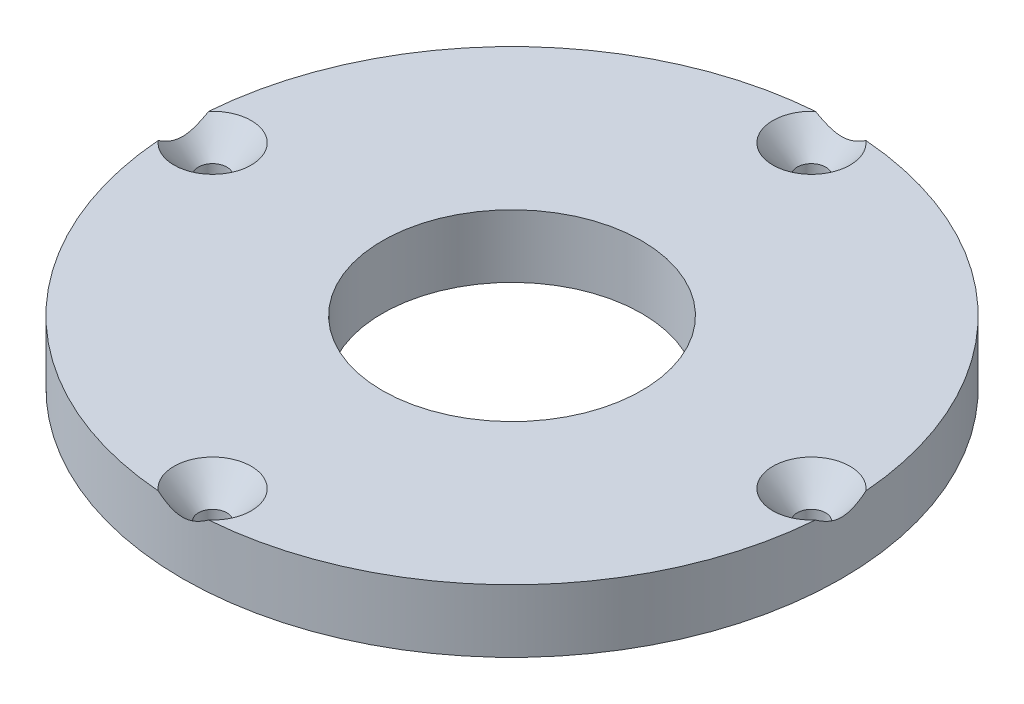
ISO-10303-21;
HEADER;
FILE_DESCRIPTION(('STEP AP214'),'2;1');
FILE_NAME('part.step','',(''),(''),'','','');
FILE_SCHEMA(('AUTOMOTIVE_DESIGN { 1 0 10303 214 1 1 1 1 }'));
ENDSEC;
DATA;
#1=APPLICATION_CONTEXT('core data for automotive mechanical design processes');
#2=APPLICATION_PROTOCOL_DEFINITION('international standard','automotive_design',2000,#1);
#3=PRODUCT_CONTEXT('',#1,'mechanical');
#4=PRODUCT('Part','Part','',(#3));
#5=PRODUCT_RELATED_PRODUCT_CATEGORY('part','',(#4));
#6=PRODUCT_DEFINITION_FORMATION('','',#4);
#7=PRODUCT_DEFINITION_CONTEXT('part definition',#1,'design');
#8=PRODUCT_DEFINITION('design','',#6,#7);
#9=PRODUCT_DEFINITION_SHAPE('','',#8);
#10=(LENGTH_UNIT() NAMED_UNIT(*) SI_UNIT(.MILLI.,.METRE.));
#11=(NAMED_UNIT(*) PLANE_ANGLE_UNIT() SI_UNIT($,.RADIAN.));
#12=(NAMED_UNIT(*) SI_UNIT($,.STERADIAN.) SOLID_ANGLE_UNIT());
#13=UNCERTAINTY_MEASURE_WITH_UNIT(LENGTH_MEASURE(1.E-05),#10,'distance_accuracy_value','');
#14=(GEOMETRIC_REPRESENTATION_CONTEXT(3) GLOBAL_UNCERTAINTY_ASSIGNED_CONTEXT((#13)) GLOBAL_UNIT_ASSIGNED_CONTEXT((#10,
#11,#12)) REPRESENTATION_CONTEXT('',''));
#15=CARTESIAN_POINT('',(0.,0.,0.));
#16=DIRECTION('',(0.,0.,1.));
#17=DIRECTION('',(1.,0.,0.));
#18=AXIS2_PLACEMENT_3D('',#15,#16,#17);
#19=CARTESIAN_POINT('',(0.,6.35,0.));
#20=DIRECTION('',(0.,-1.,0.));
#21=DIRECTION('',(0.,0.,-1.));
#22=AXIS2_PLACEMENT_3D('',#19,#20,#21);
#23=CYLINDRICAL_SURFACE('',#22,33.274);
#24=CARTESIAN_POINT('',(0.,6.35,0.));
#25=DIRECTION('',(0.,1.,0.));
#26=DIRECTION('',(0.,0.,1.));
#27=AXIS2_PLACEMENT_3D('',#24,#25,#26);
#28=CIRCLE('',#27,33.274);
#29=CARTESIAN_POINT('',(-33.1762180042017,6.35,2.5490458877165));
#30=VERTEX_POINT('',#29);
#31=CARTESIAN_POINT('',(-2.54904588771647,6.35,33.1762180042017));
#32=VERTEX_POINT('',#31);
#33=EDGE_CURVE('E64',#30,#32,#28,.T.);
#34=ORIENTED_EDGE('',*,*,#33,.F.);
#35=CARTESIAN_POINT('',(-33.1761955775648,6.3502,2.54933775698086));
#36=CARTESIAN_POINT('',(-33.1805825798049,6.31107939084975,2.49224353407827));
#37=CARTESIAN_POINT('',(-33.1848510304405,6.27250049597728,2.43476969254307));
#38=CARTESIAN_POINT('',(-33.1931441576657,6.19658644675497,2.31897186656584));
#39=CARTESIAN_POINT('',(-33.1971687808717,6.15925156556883,2.26064769939652));
#40=CARTESIAN_POINT('',(-33.2088943013344,6.04909511512583,2.08384553223999));
#41=CARTESIAN_POINT('',(-33.21621273273,5.97842751075451,1.96397900073564));
#42=CARTESIAN_POINT('',(-33.2299267423548,5.84287264009969,1.71662751721354));
#43=CARTESIAN_POINT('',(-33.2362915352426,5.77819684433707,1.58902380768307));
#44=CARTESIAN_POINT('',(-33.2477056933444,5.65973625813034,1.32892352336059));
#45=CARTESIAN_POINT('',(-33.252757166911,5.60593404296546,1.19643518556831));
#46=CARTESIAN_POINT('',(-33.2597607527403,5.53010959344534,0.97700011371498));
#47=CARTESIAN_POINT('',(-33.2621651774734,5.50373063278104,0.89157391111778));
#48=CARTESIAN_POINT('',(-33.2663443566313,5.45749882873885,0.718930100382252));
#49=CARTESIAN_POINT('',(-33.2681190973177,5.4376461277508,0.631712453202316));
#50=CARTESIAN_POINT('',(-33.2709765493234,5.40551094726472,0.456890129599175));
#51=CARTESIAN_POINT('',(-33.2720668907164,5.39314505771044,0.369301096688978));
#52=CARTESIAN_POINT('',(-33.2735544176201,5.3762413742042,0.193361047117015));
#53=CARTESIAN_POINT('',(-33.2739516632509,5.37170290129143,0.105010097213176));
#54=CARTESIAN_POINT('',(-33.2740401673081,5.37069333829633,-0.0720342768338496));
#55=CARTESIAN_POINT('',(-33.2737290643389,5.37424923209352,-0.160727859594178));
#56=CARTESIAN_POINT('',(-33.2724063706862,5.38929227282091,-0.337431416023773));
#57=CARTESIAN_POINT('',(-33.2713947189189,5.40078011136885,-0.425441329404433));
#58=CARTESIAN_POINT('',(-33.2686862677066,5.43128710485559,-0.601168319089554));
#59=CARTESIAN_POINT('',(-33.2669816807199,5.45039181327727,-0.688870240584589));
#60=CARTESIAN_POINT('',(-33.2629329615701,5.49527694915702,-0.862503889061059));
#61=CARTESIAN_POINT('',(-33.2605888461569,5.52105720177418,-0.94843566234128));
#62=CARTESIAN_POINT('',(-33.2536703765143,5.59615482408612,-1.17109467674494));
#63=CARTESIAN_POINT('',(-33.2486149947613,5.65014727225309,-1.30623006374369));
#64=CARTESIAN_POINT('',(-33.2371376661082,5.76954580051192,-1.5714421316998));
#65=CARTESIAN_POINT('',(-33.2307133355823,5.83497175250638,-1.70150951482053));
#66=CARTESIAN_POINT('',(-33.2168373397957,5.97236435376283,-1.9535315600519));
#67=CARTESIAN_POINT('',(-33.2094177537716,6.04410921552668,-2.07561016696838));
#68=CARTESIAN_POINT('',(-33.1975139212334,6.15604068896211,-2.25560127653234));
#69=CARTESIAN_POINT('',(-33.1934262548253,6.19398636529059,-2.3149562707655));
#70=CARTESIAN_POINT('',(-33.1849984365551,6.27116810514676,-2.43278419120686));
#71=CARTESIAN_POINT('',(-33.1806583435334,6.31040386703801,-2.49125731900659));
#72=CARTESIAN_POINT('',(-33.1761955775648,6.3502,-2.54933775698086));
#73=B_SPLINE_CURVE_WITH_KNOTS('',3,(#35,#36,#37,#38,#39,#40,#41,#42,#43,#44,#45,#46,#47,#48,#49,
#50,#51,#52,#53,#54,#55,#56,#57,#58,#59,#60,#61,#62,#63,#64,#65,#66,#67,#68,#69,#70,#71,#72),
.UNSPECIFIED.,.F.,.F.,(4,2,2,2,2,2,2,2,2,2,2,2,2,2,2,2,2,2,4),(0.,0.208043349461832,
0.416132084531599,0.833921512402195,1.26315987875748,1.69170484689115,1.95980491509329,
2.22791083231083,2.49297203327847,2.75801024131868,3.02393329047978,3.28987952945598,
3.55890108157153,3.82791558838638,4.26397379238092,4.70079756122368,5.12593596847389,
5.33762144708327,5.54925777837407),.UNSPECIFIED.);
#74=CARTESIAN_POINT('',(-33.1762180042017,6.35,-2.54904588771648));
#75=VERTEX_POINT('',#74);
#76=EDGE_CURVE('E11',#30,#75,#73,.T.);
#77=ORIENTED_EDGE('',*,*,#76,.T.);
#78=CARTESIAN_POINT('',(-2.5490458877165,6.35,-33.1762180042017));
#79=VERTEX_POINT('',#78);
#80=EDGE_CURVE('E88',#79,#75,#28,.T.);
#81=ORIENTED_EDGE('',*,*,#80,.F.);
#82=CARTESIAN_POINT('',(-2.54933775698085,6.3502,-33.1761955775648));
#83=CARTESIAN_POINT('',(-2.49224353407827,6.31107939084975,-33.1805825798049));
#84=CARTESIAN_POINT('',(-2.43476969254307,6.27250049597728,-33.1848510304405));
#85=CARTESIAN_POINT('',(-2.31897186656584,6.19658644675497,-33.1931441576657));
#86=CARTESIAN_POINT('',(-2.26064769939652,6.15925156556883,-33.1971687808717));
#87=CARTESIAN_POINT('',(-2.08384553223999,6.04909511512584,-33.2088943013344));
#88=CARTESIAN_POINT('',(-1.96397900073564,5.97842751075451,-33.21621273273));
#89=CARTESIAN_POINT('',(-1.71662751721354,5.84287264009969,-33.2299267423548));
#90=CARTESIAN_POINT('',(-1.58902380768307,5.77819684433707,-33.2362915352426));
#91=CARTESIAN_POINT('',(-1.32892352336059,5.65973625813034,-33.2477056933444));
#92=CARTESIAN_POINT('',(-1.19643518556831,5.60593404296546,-33.252757166911));
#93=CARTESIAN_POINT('',(-0.977000113714979,5.53010959344534,-33.2597607527403));
#94=CARTESIAN_POINT('',(-0.891573911117779,5.50373063278104,-33.2621651774734));
#95=CARTESIAN_POINT('',(-0.718930100382251,5.45749882873885,-33.2663443566313));
#96=CARTESIAN_POINT('',(-0.631712453202315,5.4376461277508,-33.2681190973177));
#97=CARTESIAN_POINT('',(-0.456890129599174,5.40551094726472,-33.2709765493234));
#98=CARTESIAN_POINT('',(-0.369301096688977,5.39314505771044,-33.2720668907164));
#99=CARTESIAN_POINT('',(-0.193361047117014,5.3762413742042,-33.2735544176201));
#100=CARTESIAN_POINT('',(-0.105010097213176,5.37170290129142,-33.2739516632509));
#101=CARTESIAN_POINT('',(0.0720342768338502,5.37069333829633,-33.2740401673081));
#102=CARTESIAN_POINT('',(0.160727859594178,5.37424923209353,-33.2737290643389));
#103=CARTESIAN_POINT('',(0.337431416023774,5.38929227282091,-33.2724063706862));
#104=CARTESIAN_POINT('',(0.425441329404434,5.40078011136885,-33.2713947189189));
#105=CARTESIAN_POINT('',(0.601168319089555,5.43128710485559,-33.2686862677066));
#106=CARTESIAN_POINT('',(0.68887024058459,5.45039181327727,-33.2669816807199));
#107=CARTESIAN_POINT('',(0.86250388906106,5.49527694915702,-33.2629329615701));
#108=CARTESIAN_POINT('',(0.948435662341281,5.52105720177418,-33.2605888461569));
#109=CARTESIAN_POINT('',(1.17109467674494,5.59615482408612,-33.2536703765143));
#110=CARTESIAN_POINT('',(1.30623006374369,5.65014727225309,-33.2486149947613));
#111=CARTESIAN_POINT('',(1.5714421316998,5.76954580051192,-33.2371376661082));
#112=CARTESIAN_POINT('',(1.70150951482053,5.83497175250639,-33.2307133355823));
#113=CARTESIAN_POINT('',(1.9535315600519,5.97236435376283,-33.2168373397957));
#114=CARTESIAN_POINT('',(2.07561016696838,6.04410921552668,-33.2094177537716));
#115=CARTESIAN_POINT('',(2.25560127653234,6.15604068896211,-33.1975139212334));
#116=CARTESIAN_POINT('',(2.3149562707655,6.19398636529059,-33.1934262548253));
#117=CARTESIAN_POINT('',(2.43278419120686,6.27116810514676,-33.1849984365551));
#118=CARTESIAN_POINT('',(2.49125731900659,6.31040386703801,-33.1806583435334));
#119=CARTESIAN_POINT('',(2.54933775698085,6.3502,-33.1761955775648));
#120=B_SPLINE_CURVE_WITH_KNOTS('',3,(#82,#83,#84,#85,#86,#87,#88,#89,#90,#91,#92,#93,#94,#95,
#96,#97,#98,#99,#100,#101,#102,#103,#104,#105,#106,#107,#108,#109,#110,#111,#112,#113,#114,#115,
#116,#117,#118,#119),.UNSPECIFIED.,.F.,.F.,(4,2,2,2,2,2,2,2,2,2,2,2,2,2,2,2,2,2,4),(0.,
0.208043349461831,0.416132084531599,0.833921512402194,1.26315987875747,1.69170484689115,
1.95980491509329,2.22791083231083,2.49297203327847,2.75801024131868,3.02393329047978,
3.28987952945598,3.55890108157154,3.82791558838638,4.26397379238092,4.70079756122368,
5.12593596847389,5.33762144708327,5.54925777837407),.UNSPECIFIED.);
#121=CARTESIAN_POINT('',(2.54904588771647,6.35,-33.1762180042017));
#122=VERTEX_POINT('',#121);
#123=EDGE_CURVE('E102',#79,#122,#120,.T.);
#124=ORIENTED_EDGE('',*,*,#123,.T.);
#125=CARTESIAN_POINT('',(33.1762180042017,6.35,-2.5490458877165));
#126=VERTEX_POINT('',#125);
#127=EDGE_CURVE('E103',#126,#122,#28,.T.);
#128=ORIENTED_EDGE('',*,*,#127,.F.);
#129=CARTESIAN_POINT('',(33.1761955775648,6.3502,-2.54933775698086));
#130=CARTESIAN_POINT('',(33.1805825798049,6.31107939084975,-2.49224353407827));
#131=CARTESIAN_POINT('',(33.1848510304405,6.27250049597728,-2.43476969254307));
#132=CARTESIAN_POINT('',(33.1931441576657,6.19658644675497,-2.31897186656584));
#133=CARTESIAN_POINT('',(33.1971687808717,6.15925156556883,-2.26064769939652));
#134=CARTESIAN_POINT('',(33.2088943013344,6.04909511512583,-2.08384553223999));
#135=CARTESIAN_POINT('',(33.21621273273,5.97842751075451,-1.96397900073564));
#136=CARTESIAN_POINT('',(33.2299267423548,5.84287264009969,-1.71662751721354));
#137=CARTESIAN_POINT('',(33.2362915352426,5.77819684433707,-1.58902380768307));
#138=CARTESIAN_POINT('',(33.2477056933444,5.65973625813034,-1.32892352336059));
#139=CARTESIAN_POINT('',(33.252757166911,5.60593404296546,-1.19643518556831));
#140=CARTESIAN_POINT('',(33.2597607527403,5.53010959344534,-0.97700011371498));
#141=CARTESIAN_POINT('',(33.2621651774734,5.50373063278104,-0.89157391111778));
#142=CARTESIAN_POINT('',(33.2663443566313,5.45749882873885,-0.718930100382252));
#143=CARTESIAN_POINT('',(33.2681190973177,5.4376461277508,-0.631712453202316));
#144=CARTESIAN_POINT('',(33.2709765493234,5.40551094726472,-0.456890129599175));
#145=CARTESIAN_POINT('',(33.2720668907164,5.39314505771044,-0.369301096688978));
#146=CARTESIAN_POINT('',(33.2735544176201,5.3762413742042,-0.193361047117015));
#147=CARTESIAN_POINT('',(33.2739516632509,5.37170290129143,-0.105010097213176));
#148=CARTESIAN_POINT('',(33.2740401673081,5.37069333829633,0.0720342768338496));
#149=CARTESIAN_POINT('',(33.2737290643389,5.37424923209352,0.160727859594178));
#150=CARTESIAN_POINT('',(33.2724063706862,5.38929227282091,0.337431416023773));
#151=CARTESIAN_POINT('',(33.2713947189189,5.40078011136885,0.425441329404433));
#152=CARTESIAN_POINT('',(33.2686862677066,5.43128710485559,0.601168319089554));
#153=CARTESIAN_POINT('',(33.2669816807199,5.45039181327727,0.688870240584589));
#154=CARTESIAN_POINT('',(33.2629329615701,5.49527694915702,0.862503889061059));
#155=CARTESIAN_POINT('',(33.2605888461569,5.52105720177418,0.94843566234128));
#156=CARTESIAN_POINT('',(33.2536703765143,5.59615482408612,1.17109467674494));
#157=CARTESIAN_POINT('',(33.2486149947613,5.65014727225309,1.30623006374369));
#158=CARTESIAN_POINT('',(33.2371376661082,5.76954580051192,1.5714421316998));
#159=CARTESIAN_POINT('',(33.2307133355823,5.83497175250638,1.70150951482053));
#160=CARTESIAN_POINT('',(33.2168373397957,5.97236435376283,1.9535315600519));
#161=CARTESIAN_POINT('',(33.2094177537716,6.04410921552668,2.07561016696838));
#162=CARTESIAN_POINT('',(33.1975139212334,6.15604068896211,2.25560127653234));
#163=CARTESIAN_POINT('',(33.1934262548253,6.19398636529059,2.3149562707655));
#164=CARTESIAN_POINT('',(33.1849984365551,6.27116810514676,2.43278419120686));
#165=CARTESIAN_POINT('',(33.1806583435334,6.31040386703801,2.49125731900659));
#166=CARTESIAN_POINT('',(33.1761955775648,6.3502,2.54933775698086));
#167=B_SPLINE_CURVE_WITH_KNOTS('',3,(#129,#130,#131,#132,#133,#134,#135,#136,#137,#138,#139,
#140,#141,#142,#143,#144,#145,#146,#147,#148,#149,#150,#151,#152,#153,#154,#155,#156,#157,#158,
#159,#160,#161,#162,#163,#164,#165,#166),.UNSPECIFIED.,.F.,.F.,(4,2,2,2,2,2,2,2,2,2,2,2,2,2,2,2,
2,2,4),(0.,0.208043349461832,0.416132084531599,0.833921512402195,1.26315987875748,
1.69170484689115,1.95980491509329,2.22791083231083,2.49297203327847,2.75801024131868,
3.02393329047978,3.28987952945598,3.55890108157153,3.82791558838638,4.26397379238092,
4.70079756122368,5.12593596847389,5.33762144708327,5.54925777837407),.UNSPECIFIED.);
#168=CARTESIAN_POINT('',(33.1762180042017,6.35,2.54904588771648));
#169=VERTEX_POINT('',#168);
#170=EDGE_CURVE('E121',#126,#169,#167,.T.);
#171=ORIENTED_EDGE('',*,*,#170,.T.);
#172=CARTESIAN_POINT('',(2.5490458877165,6.35,33.1762180042017));
#173=VERTEX_POINT('',#172);
#174=EDGE_CURVE('E97',#173,#169,#28,.T.);
#175=ORIENTED_EDGE('',*,*,#174,.F.);
#176=CARTESIAN_POINT('',(2.54933775698085,6.3502,33.1761955775648));
#177=CARTESIAN_POINT('',(2.49224353407827,6.31107939084975,33.1805825798049));
#178=CARTESIAN_POINT('',(2.43476969254307,6.27250049597728,33.1848510304405));
#179=CARTESIAN_POINT('',(2.31897186656584,6.19658644675497,33.1931441576657));
#180=CARTESIAN_POINT('',(2.26064769939652,6.15925156556883,33.1971687808717));
#181=CARTESIAN_POINT('',(2.08384553223999,6.04909511512584,33.2088943013344));
#182=CARTESIAN_POINT('',(1.96397900073564,5.97842751075451,33.21621273273));
#183=CARTESIAN_POINT('',(1.71662751721354,5.84287264009969,33.2299267423548));
#184=CARTESIAN_POINT('',(1.58902380768307,5.77819684433707,33.2362915352426));
#185=CARTESIAN_POINT('',(1.32892352336059,5.65973625813034,33.2477056933444));
#186=CARTESIAN_POINT('',(1.19643518556831,5.60593404296546,33.252757166911));
#187=CARTESIAN_POINT('',(0.977000113714979,5.53010959344534,33.2597607527403));
#188=CARTESIAN_POINT('',(0.891573911117779,5.50373063278104,33.2621651774734));
#189=CARTESIAN_POINT('',(0.718930100382251,5.45749882873885,33.2663443566313));
#190=CARTESIAN_POINT('',(0.631712453202315,5.4376461277508,33.2681190973177));
#191=CARTESIAN_POINT('',(0.456890129599174,5.40551094726472,33.2709765493234));
#192=CARTESIAN_POINT('',(0.369301096688977,5.39314505771044,33.2720668907164));
#193=CARTESIAN_POINT('',(0.193361047117014,5.3762413742042,33.2735544176201));
#194=CARTESIAN_POINT('',(0.105010097213176,5.37170290129142,33.2739516632509));
#195=CARTESIAN_POINT('',(-0.0720342768338502,5.37069333829633,33.2740401673081));
#196=CARTESIAN_POINT('',(-0.160727859594178,5.37424923209353,33.2737290643389));
#197=CARTESIAN_POINT('',(-0.337431416023774,5.38929227282091,33.2724063706862));
#198=CARTESIAN_POINT('',(-0.425441329404434,5.40078011136885,33.2713947189189));
#199=CARTESIAN_POINT('',(-0.601168319089555,5.43128710485559,33.2686862677066));
#200=CARTESIAN_POINT('',(-0.68887024058459,5.45039181327727,33.2669816807199));
#201=CARTESIAN_POINT('',(-0.86250388906106,5.49527694915702,33.2629329615701));
#202=CARTESIAN_POINT('',(-0.948435662341281,5.52105720177418,33.2605888461569));
#203=CARTESIAN_POINT('',(-1.17109467674494,5.59615482408612,33.2536703765143));
#204=CARTESIAN_POINT('',(-1.30623006374369,5.65014727225309,33.2486149947613));
#205=CARTESIAN_POINT('',(-1.5714421316998,5.76954580051192,33.2371376661082));
#206=CARTESIAN_POINT('',(-1.70150951482053,5.83497175250639,33.2307133355823));
#207=CARTESIAN_POINT('',(-1.9535315600519,5.97236435376283,33.2168373397957));
#208=CARTESIAN_POINT('',(-2.07561016696838,6.04410921552668,33.2094177537716));
#209=CARTESIAN_POINT('',(-2.25560127653234,6.15604068896211,33.1975139212334));
#210=CARTESIAN_POINT('',(-2.3149562707655,6.19398636529059,33.1934262548253));
#211=CARTESIAN_POINT('',(-2.43278419120686,6.27116810514676,33.1849984365551));
#212=CARTESIAN_POINT('',(-2.49125731900659,6.31040386703801,33.1806583435334));
#213=CARTESIAN_POINT('',(-2.54933775698085,6.3502,33.1761955775648));
#214=B_SPLINE_CURVE_WITH_KNOTS('',3,(#176,#177,#178,#179,#180,#181,#182,#183,#184,#185,#186,
#187,#188,#189,#190,#191,#192,#193,#194,#195,#196,#197,#198,#199,#200,#201,#202,#203,#204,#205,
#206,#207,#208,#209,#210,#211,#212,#213),.UNSPECIFIED.,.F.,.F.,(4,2,2,2,2,2,2,2,2,2,2,2,2,2,2,2,
2,2,4),(0.,0.208043349461831,0.416132084531599,0.833921512402194,1.26315987875747,
1.69170484689115,1.95980491509329,2.22791083231083,2.49297203327847,2.75801024131868,
3.02393329047978,3.28987952945598,3.55890108157154,3.82791558838638,4.26397379238092,
4.70079756122368,5.12593596847389,5.33762144708327,5.54925777837407),.UNSPECIFIED.);
#215=EDGE_CURVE('E52',#173,#32,#214,.T.);
#216=ORIENTED_EDGE('',*,*,#215,.T.);
#217=EDGE_LOOP('',(#34,#77,#81,#124,#128,#171,#175,#216));
#218=FACE_BOUND('',#217,.T.);
#219=CARTESIAN_POINT('',(0.,0.,0.));
#220=DIRECTION('',(0.,1.,0.));
#221=DIRECTION('',(0.,0.,1.));
#222=AXIS2_PLACEMENT_3D('',#219,#220,#221);
#223=CIRCLE('',#222,33.274);
#224=CARTESIAN_POINT('',(0.,0.,33.274));
#225=VERTEX_POINT('',#224);
#226=EDGE_CURVE('E108',#225,#225,#223,.T.);
#227=ORIENTED_EDGE('',*,*,#226,.T.);
#228=EDGE_LOOP('',(#227));
#229=FACE_BOUND('',#228,.T.);
#230=ADVANCED_FACE('F42',(#218,#229),#23,.T.);
#231=CARTESIAN_POINT('',(0.,6.35,0.));
#232=DIRECTION('',(0.,1.,0.));
#233=DIRECTION('',(0.,0.,1.));
#234=AXIS2_PLACEMENT_3D('',#231,#232,#233);
#235=PLANE('',#234);
#236=CARTESIAN_POINT('',(0.,6.35,0.));
#237=DIRECTION('',(0.,1.,0.));
#238=DIRECTION('',(0.,0.,1.));
#239=AXIS2_PLACEMENT_3D('',#236,#237,#238);
#240=CIRCLE('',#239,13.096875);
#241=CARTESIAN_POINT('',(0.,6.35,13.096875));
#242=VERTEX_POINT('',#241);
#243=EDGE_CURVE('E372',#242,#242,#240,.T.);
#244=ORIENTED_EDGE('',*,*,#243,.F.);
#245=EDGE_LOOP('',(#244));
#246=FACE_BOUND('',#245,.T.);
#247=CARTESIAN_POINT('',(-30.226,6.35,0.));
#248=DIRECTION('',(0.,1.,0.));
#249=DIRECTION('',(0.,0.,1.));
#250=AXIS2_PLACEMENT_3D('',#247,#248,#249);
#251=CIRCLE('',#250,3.8989);
#252=EDGE_CURVE('E58',#30,#75,#251,.T.);
#253=ORIENTED_EDGE('',*,*,#252,.F.);
#254=ORIENTED_EDGE('',*,*,#33,.T.);
#255=CARTESIAN_POINT('',(0.,6.35,30.226));
#256=DIRECTION('',(0.,1.,0.));
#257=DIRECTION('',(0.,0.,1.));
#258=AXIS2_PLACEMENT_3D('',#255,#256,#257);
#259=CIRCLE('',#258,3.8989);
#260=EDGE_CURVE('E359',#173,#32,#259,.T.);
#261=ORIENTED_EDGE('',*,*,#260,.F.);
#262=ORIENTED_EDGE('',*,*,#174,.T.);
#263=CARTESIAN_POINT('',(30.226,6.35,0.));
#264=DIRECTION('',(0.,1.,0.));
#265=DIRECTION('',(0.,0.,1.));
#266=AXIS2_PLACEMENT_3D('',#263,#264,#265);
#267=CIRCLE('',#266,3.8989);
#268=EDGE_CURVE('E327',#126,#169,#267,.T.);
#269=ORIENTED_EDGE('',*,*,#268,.F.);
#270=ORIENTED_EDGE('',*,*,#127,.T.);
#271=CARTESIAN_POINT('',(0.,6.35,-30.226));
#272=DIRECTION('',(0.,1.,0.));
#273=DIRECTION('',(0.,0.,1.));
#274=AXIS2_PLACEMENT_3D('',#271,#272,#273);
#275=CIRCLE('',#274,3.8989);
#276=EDGE_CURVE('E320',#79,#122,#275,.T.);
#277=ORIENTED_EDGE('',*,*,#276,.F.);
#278=ORIENTED_EDGE('',*,*,#80,.T.);
#279=EDGE_LOOP('',(#253,#254,#261,#262,#269,#270,#277,#278));
#280=FACE_BOUND('',#279,.T.);
#281=ADVANCED_FACE('F86',(#246,#280),#235,.T.);
#282=CARTESIAN_POINT('',(0.,0.,0.));
#283=DIRECTION('',(0.,1.,0.));
#284=DIRECTION('',(0.,0.,1.));
#285=AXIS2_PLACEMENT_3D('',#282,#283,#284);
#286=PLANE('',#285);
#287=CARTESIAN_POINT('',(0.,0.,0.));
#288=DIRECTION('',(0.,1.,0.));
#289=DIRECTION('',(0.,0.,1.));
#290=AXIS2_PLACEMENT_3D('',#287,#288,#289);
#291=CIRCLE('',#290,13.096875);
#292=CARTESIAN_POINT('',(0.,0.,13.096875));
#293=VERTEX_POINT('',#292);
#294=EDGE_CURVE('E91',#293,#293,#291,.T.);
#295=ORIENTED_EDGE('',*,*,#294,.T.);
#296=EDGE_LOOP('',(#295));
#297=FACE_BOUND('',#296,.T.);
#298=CARTESIAN_POINT('',(-30.226,0.,0.));
#299=DIRECTION('',(0.,1.,0.));
#300=DIRECTION('',(0.,0.,1.));
#301=AXIS2_PLACEMENT_3D('',#298,#299,#300);
#302=CIRCLE('',#301,1.43509999999999);
#303=CARTESIAN_POINT('',(-30.226,0.,1.43509999999999));
#304=VERTEX_POINT('',#303);
#305=EDGE_CURVE('E46',#304,#304,#302,.T.);
#306=ORIENTED_EDGE('',*,*,#305,.T.);
#307=EDGE_LOOP('',(#306));
#308=FACE_BOUND('',#307,.T.);
#309=CARTESIAN_POINT('',(0.,0.,30.226));
#310=DIRECTION('',(0.,1.,0.));
#311=DIRECTION('',(0.,0.,1.));
#312=AXIS2_PLACEMENT_3D('',#309,#310,#311);
#313=CIRCLE('',#312,1.43509999999999);
#314=CARTESIAN_POINT('',(0.,0.,31.6611));
#315=VERTEX_POINT('',#314);
#316=EDGE_CURVE('E340',#315,#315,#313,.T.);
#317=ORIENTED_EDGE('',*,*,#316,.T.);
#318=EDGE_LOOP('',(#317));
#319=FACE_BOUND('',#318,.T.);
#320=CARTESIAN_POINT('',(30.226,0.,0.));
#321=DIRECTION('',(0.,1.,0.));
#322=DIRECTION('',(0.,0.,1.));
#323=AXIS2_PLACEMENT_3D('',#320,#321,#322);
#324=CIRCLE('',#323,1.43509999999999);
#325=CARTESIAN_POINT('',(30.226,0.,1.43509999999999));
#326=VERTEX_POINT('',#325);
#327=EDGE_CURVE('E317',#326,#326,#324,.T.);
#328=ORIENTED_EDGE('',*,*,#327,.T.);
#329=EDGE_LOOP('',(#328));
#330=FACE_BOUND('',#329,.T.);
#331=CARTESIAN_POINT('',(0.,0.,-30.226));
#332=DIRECTION('',(0.,1.,0.));
#333=DIRECTION('',(0.,0.,1.));
#334=AXIS2_PLACEMENT_3D('',#331,#332,#333);
#335=CIRCLE('',#334,1.43509999999999);
#336=CARTESIAN_POINT('',(0.,0.,-28.7909));
#337=VERTEX_POINT('',#336);
#338=EDGE_CURVE('E112',#337,#337,#335,.T.);
#339=ORIENTED_EDGE('',*,*,#338,.T.);
#340=EDGE_LOOP('',(#339));
#341=FACE_BOUND('',#340,.T.);
#342=ORIENTED_EDGE('',*,*,#226,.F.);
#343=EDGE_LOOP('',(#342));
#344=FACE_BOUND('',#343,.T.);
#345=ADVANCED_FACE('F134',(#297,#308,#319,#330,#341,#344),#286,.F.);
#346=CARTESIAN_POINT('',(0.,6.35,-30.226));
#347=DIRECTION('',(0.,1.,0.));
#348=DIRECTION('',(0.,0.,1.));
#349=AXIS2_PLACEMENT_3D('',#346,#347,#348);
#350=CYLINDRICAL_SURFACE('',#349,1.43509999999999);
#351=CARTESIAN_POINT('',(0.,3.51572231828888,-30.226));
#352=DIRECTION('',(0.,1.,0.));
#353=DIRECTION('',(0.,0.,1.));
#354=AXIS2_PLACEMENT_3D('',#351,#352,#353);
#355=CIRCLE('',#354,1.4351);
#356=CARTESIAN_POINT('',(0.,3.51572231828888,-28.7909));
#357=VERTEX_POINT('',#356);
#358=EDGE_CURVE('E106',#357,#357,#355,.T.);
#359=ORIENTED_EDGE('',*,*,#358,.T.);
#360=EDGE_LOOP('',(#359));
#361=FACE_BOUND('',#360,.T.);
#362=ORIENTED_EDGE('',*,*,#338,.F.);
#363=EDGE_LOOP('',(#362));
#364=FACE_BOUND('',#363,.T.);
#365=ADVANCED_FACE('F129',(#361,#364),#350,.F.);
#366=CARTESIAN_POINT('',(0.,6.35,-30.226));
#367=DIRECTION('',(0.,1.,0.));
#368=DIRECTION('',(0.,0.,1.));
#369=AXIS2_PLACEMENT_3D('',#366,#367,#368);
#370=CONICAL_SURFACE('',#369,3.8989,0.715584993317676);
#371=ORIENTED_EDGE('',*,*,#358,.F.);
#372=EDGE_LOOP('',(#371));
#373=FACE_BOUND('',#372,.T.);
#374=ORIENTED_EDGE('',*,*,#276,.T.);
#375=ORIENTED_EDGE('',*,*,#123,.F.);
#376=EDGE_LOOP('',(#374,#375));
#377=FACE_BOUND('',#376,.T.);
#378=ADVANCED_FACE('F123',(#373,#377),#370,.F.);
#379=CARTESIAN_POINT('',(30.226,6.35,0.));
#380=DIRECTION('',(0.,1.,0.));
#381=DIRECTION('',(0.,0.,1.));
#382=AXIS2_PLACEMENT_3D('',#379,#380,#381);
#383=CYLINDRICAL_SURFACE('',#382,1.43509999999999);
#384=CARTESIAN_POINT('',(30.226,3.51572231828888,0.));
#385=DIRECTION('',(0.,1.,0.));
#386=DIRECTION('',(0.,0.,1.));
#387=AXIS2_PLACEMENT_3D('',#384,#385,#386);
#388=CIRCLE('',#387,1.4351);
#389=CARTESIAN_POINT('',(30.226,3.51572231828888,1.4351));
#390=VERTEX_POINT('',#389);
#391=EDGE_CURVE('E314',#390,#390,#388,.T.);
#392=ORIENTED_EDGE('',*,*,#391,.T.);
#393=EDGE_LOOP('',(#392));
#394=FACE_BOUND('',#393,.T.);
#395=ORIENTED_EDGE('',*,*,#327,.F.);
#396=EDGE_LOOP('',(#395));
#397=FACE_BOUND('',#396,.T.);
#398=ADVANCED_FACE('F128',(#394,#397),#383,.F.);
#399=CARTESIAN_POINT('',(30.226,6.35,0.));
#400=DIRECTION('',(0.,1.,0.));
#401=DIRECTION('',(0.,0.,1.));
#402=AXIS2_PLACEMENT_3D('',#399,#400,#401);
#403=CONICAL_SURFACE('',#402,3.8989,0.715584993317676);
#404=ORIENTED_EDGE('',*,*,#391,.F.);
#405=EDGE_LOOP('',(#404));
#406=FACE_BOUND('',#405,.T.);
#407=ORIENTED_EDGE('',*,*,#268,.T.);
#408=ORIENTED_EDGE('',*,*,#170,.F.);
#409=EDGE_LOOP('',(#407,#408));
#410=FACE_BOUND('',#409,.T.);
#411=ADVANCED_FACE('F170',(#406,#410),#403,.F.);
#412=CARTESIAN_POINT('',(0.,6.35,30.226));
#413=DIRECTION('',(0.,1.,0.));
#414=DIRECTION('',(0.,0.,1.));
#415=AXIS2_PLACEMENT_3D('',#412,#413,#414);
#416=CYLINDRICAL_SURFACE('',#415,1.43509999999999);
#417=CARTESIAN_POINT('',(0.,3.51572231828888,30.226));
#418=DIRECTION('',(0.,1.,0.));
#419=DIRECTION('',(0.,0.,1.));
#420=AXIS2_PLACEMENT_3D('',#417,#418,#419);
#421=CIRCLE('',#420,1.4351);
#422=CARTESIAN_POINT('',(0.,3.51572231828888,31.6611));
#423=VERTEX_POINT('',#422);
#424=EDGE_CURVE('E350',#423,#423,#421,.T.);
#425=ORIENTED_EDGE('',*,*,#424,.T.);
#426=EDGE_LOOP('',(#425));
#427=FACE_BOUND('',#426,.T.);
#428=ORIENTED_EDGE('',*,*,#316,.F.);
#429=EDGE_LOOP('',(#428));
#430=FACE_BOUND('',#429,.T.);
#431=ADVANCED_FACE('F174',(#427,#430),#416,.F.);
#432=CARTESIAN_POINT('',(0.,6.35,30.226));
#433=DIRECTION('',(0.,1.,0.));
#434=DIRECTION('',(0.,0.,1.));
#435=AXIS2_PLACEMENT_3D('',#432,#433,#434);
#436=CONICAL_SURFACE('',#435,3.8989,0.715584993317676);
#437=ORIENTED_EDGE('',*,*,#424,.F.);
#438=EDGE_LOOP('',(#437));
#439=FACE_BOUND('',#438,.T.);
#440=ORIENTED_EDGE('',*,*,#260,.T.);
#441=ORIENTED_EDGE('',*,*,#215,.F.);
#442=EDGE_LOOP('',(#440,#441));
#443=FACE_BOUND('',#442,.T.);
#444=ADVANCED_FACE('F181',(#439,#443),#436,.F.);
#445=CARTESIAN_POINT('',(-30.226,6.35,0.));
#446=DIRECTION('',(0.,1.,0.));
#447=DIRECTION('',(0.,0.,1.));
#448=AXIS2_PLACEMENT_3D('',#445,#446,#447);
#449=CYLINDRICAL_SURFACE('',#448,1.43509999999999);
#450=CARTESIAN_POINT('',(-30.226,3.51572231828888,0.));
#451=DIRECTION('',(0.,1.,0.));
#452=DIRECTION('',(0.,0.,1.));
#453=AXIS2_PLACEMENT_3D('',#450,#451,#452);
#454=CIRCLE('',#453,1.4351);
#455=CARTESIAN_POINT('',(-30.226,3.51572231828888,1.4351));
#456=VERTEX_POINT('',#455);
#457=EDGE_CURVE('E90',#456,#456,#454,.T.);
#458=ORIENTED_EDGE('',*,*,#457,.T.);
#459=EDGE_LOOP('',(#458));
#460=FACE_BOUND('',#459,.T.);
#461=ORIENTED_EDGE('',*,*,#305,.F.);
#462=EDGE_LOOP('',(#461));
#463=FACE_BOUND('',#462,.T.);
#464=ADVANCED_FACE('F185',(#460,#463),#449,.F.);
#465=CARTESIAN_POINT('',(-30.226,6.35,0.));
#466=DIRECTION('',(0.,1.,0.));
#467=DIRECTION('',(0.,0.,1.));
#468=AXIS2_PLACEMENT_3D('',#465,#466,#467);
#469=CONICAL_SURFACE('',#468,3.8989,0.715584993317676);
#470=ORIENTED_EDGE('',*,*,#457,.F.);
#471=EDGE_LOOP('',(#470));
#472=FACE_BOUND('',#471,.T.);
#473=ORIENTED_EDGE('',*,*,#252,.T.);
#474=ORIENTED_EDGE('',*,*,#76,.F.);
#475=EDGE_LOOP('',(#473,#474));
#476=FACE_BOUND('',#475,.T.);
#477=ADVANCED_FACE('F82',(#472,#476),#469,.F.);
#478=CARTESIAN_POINT('',(0.,6.35,0.));
#479=DIRECTION('',(0.,1.,0.));
#480=DIRECTION('',(0.,0.,1.));
#481=AXIS2_PLACEMENT_3D('',#478,#479,#480);
#482=CYLINDRICAL_SURFACE('',#481,13.096875);
#483=ORIENTED_EDGE('',*,*,#294,.F.);
#484=EDGE_LOOP('',(#483));
#485=FACE_BOUND('',#484,.T.);
#486=ORIENTED_EDGE('',*,*,#243,.T.);
#487=EDGE_LOOP('',(#486));
#488=FACE_BOUND('',#487,.T.);
#489=ADVANCED_FACE('F196',(#485,#488),#482,.F.);
#490=CLOSED_SHELL('',(#230,#281,#345,#365,#378,#398,#411,#431,#444,#464,#477,#489));
#491=MANIFOLD_SOLID_BREP('B2',#490);
#492=ADVANCED_BREP_SHAPE_REPRESENTATION('',(#18,#491),#14);
#493=SHAPE_DEFINITION_REPRESENTATION(#9,#492);
ENDSEC;
END-ISO-10303-21;
